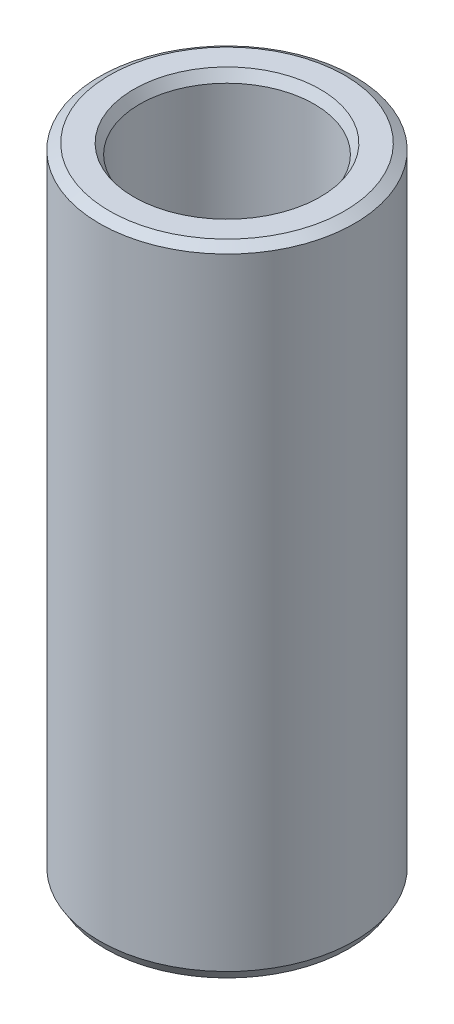
ISO-10303-21;
HEADER;
FILE_DESCRIPTION(('STEP AP214'),'2;1');
FILE_NAME('part.step','',(''),(''),'','','');
FILE_SCHEMA(('AUTOMOTIVE_DESIGN { 1 0 10303 214 1 1 1 1 }'));
ENDSEC;
DATA;
#1=APPLICATION_CONTEXT('core data for automotive mechanical design processes');
#2=APPLICATION_PROTOCOL_DEFINITION('international standard','automotive_design',2000,#1);
#3=PRODUCT_CONTEXT('',#1,'mechanical');
#4=PRODUCT('Part','Part','',(#3));
#5=PRODUCT_RELATED_PRODUCT_CATEGORY('part','',(#4));
#6=PRODUCT_DEFINITION_FORMATION('','',#4);
#7=PRODUCT_DEFINITION_CONTEXT('part definition',#1,'design');
#8=PRODUCT_DEFINITION('design','',#6,#7);
#9=PRODUCT_DEFINITION_SHAPE('','',#8);
#10=(LENGTH_UNIT() NAMED_UNIT(*) SI_UNIT(.MILLI.,.METRE.));
#11=(NAMED_UNIT(*) PLANE_ANGLE_UNIT() SI_UNIT($,.RADIAN.));
#12=(NAMED_UNIT(*) SI_UNIT($,.STERADIAN.) SOLID_ANGLE_UNIT());
#13=UNCERTAINTY_MEASURE_WITH_UNIT(LENGTH_MEASURE(1.E-05),#10,'distance_accuracy_value','');
#14=(GEOMETRIC_REPRESENTATION_CONTEXT(3) GLOBAL_UNCERTAINTY_ASSIGNED_CONTEXT((#13)) GLOBAL_UNIT_ASSIGNED_CONTEXT((#10,
#11,#12)) REPRESENTATION_CONTEXT('',''));
#15=CARTESIAN_POINT('',(0.,0.,0.));
#16=DIRECTION('',(0.,0.,1.));
#17=DIRECTION('',(1.,0.,0.));
#18=AXIS2_PLACEMENT_3D('',#15,#16,#17);
#19=CARTESIAN_POINT('',(0.,224.977429232569,0.));
#20=DIRECTION('',(0.,-1.,0.));
#21=DIRECTION('',(0.,0.,-1.));
#22=AXIS2_PLACEMENT_3D('',#19,#20,#21);
#23=CYLINDRICAL_SURFACE('',#22,45.);
#24=CARTESIAN_POINT('',(0.,3.47307751984191,0.));
#25=DIRECTION('',(0.,1.,0.));
#26=DIRECTION('',(0.,0.,1.));
#27=AXIS2_PLACEMENT_3D('',#24,#25,#26);
#28=CIRCLE('',#27,45.);
#29=CARTESIAN_POINT('',(0.,3.47307751984188,-45.));
#30=VERTEX_POINT('',#29);
#31=EDGE_CURVE('E10',#30,#30,#28,.T.);
#32=CARTESIAN_POINT('',(0.,222.857607151526,0.));
#33=DIRECTION('',(0.,1.,0.));
#34=DIRECTION('',(0.,0.,1.));
#35=AXIS2_PLACEMENT_3D('',#32,#33,#34);
#36=CIRCLE('',#35,45.);
#37=CARTESIAN_POINT('',(0.,222.857607151526,-45.));
#38=VERTEX_POINT('',#37);
#39=EDGE_CURVE('E50',#38,#38,#36,.F.);
#40=CARTESIAN_POINT('',(0.,3.47307751984188,-45.));
#41=CARTESIAN_POINT('',(0.,5.75833303683859,-45.));
#42=CARTESIAN_POINT('',(0.,8.0435885538353,-45.));
#43=CARTESIAN_POINT('',(0.,12.6140995878287,-45.));
#44=CARTESIAN_POINT('',(0.,14.8993551048254,-45.));
#45=CARTESIAN_POINT('',(0.,19.4698661388189,-45.));
#46=CARTESIAN_POINT('',(0.,21.7551216558156,-45.));
#47=CARTESIAN_POINT('',(0.,26.325632689809,-45.));
#48=CARTESIAN_POINT('',(0.,28.6108882068057,-45.));
#49=CARTESIAN_POINT('',(0.,33.1813992407992,-45.));
#50=CARTESIAN_POINT('',(0.,35.4666547577959,-45.));
#51=CARTESIAN_POINT('',(0.,40.0371657917893,-45.));
#52=CARTESIAN_POINT('',(0.,42.322421308786,-45.));
#53=CARTESIAN_POINT('',(0.,46.8929323427794,-45.));
#54=CARTESIAN_POINT('',(0.,49.1781878597761,-45.));
#55=CARTESIAN_POINT('',(0.,53.7486988937696,-45.));
#56=CARTESIAN_POINT('',(0.,56.0339544107663,-45.));
#57=CARTESIAN_POINT('',(0.,60.6044654447597,-45.));
#58=CARTESIAN_POINT('',(0.,62.8897209617564,-45.));
#59=CARTESIAN_POINT('',(0.,67.4602319957499,-45.));
#60=CARTESIAN_POINT('',(0.,69.7454875127466,-45.));
#61=CARTESIAN_POINT('',(0.,74.31599854674,-45.));
#62=CARTESIAN_POINT('',(0.,76.6012540637367,-45.));
#63=CARTESIAN_POINT('',(0.,81.1717650977301,-45.));
#64=CARTESIAN_POINT('',(0.,83.4570206147268,-45.));
#65=CARTESIAN_POINT('',(0.,88.0275316487203,-45.));
#66=CARTESIAN_POINT('',(0.,90.312787165717,-45.));
#67=CARTESIAN_POINT('',(0.,94.8832981997104,-45.));
#68=CARTESIAN_POINT('',(0.,97.1685537167071,-45.));
#69=CARTESIAN_POINT('',(0.,101.739064750701,-45.));
#70=CARTESIAN_POINT('',(0.,104.024320267697,-45.));
#71=CARTESIAN_POINT('',(0.,108.594831301691,-45.));
#72=CARTESIAN_POINT('',(0.,110.880086818687,-45.));
#73=CARTESIAN_POINT('',(0.,115.450597852681,-45.));
#74=CARTESIAN_POINT('',(0.,117.735853369678,-45.));
#75=CARTESIAN_POINT('',(0.,122.306364403671,-45.));
#76=CARTESIAN_POINT('',(0.,124.591619920668,-45.));
#77=CARTESIAN_POINT('',(0.,129.162130954661,-45.));
#78=CARTESIAN_POINT('',(0.,131.447386471658,-45.));
#79=CARTESIAN_POINT('',(0.,136.017897505651,-45.));
#80=CARTESIAN_POINT('',(0.,138.303153022648,-45.));
#81=CARTESIAN_POINT('',(0.,142.873664056641,-45.));
#82=CARTESIAN_POINT('',(0.,145.158919573638,-45.));
#83=CARTESIAN_POINT('',(0.,149.729430607632,-45.));
#84=CARTESIAN_POINT('',(0.,152.014686124628,-45.));
#85=CARTESIAN_POINT('',(0.,156.585197158622,-45.));
#86=CARTESIAN_POINT('',(0.,158.870452675618,-45.));
#87=CARTESIAN_POINT('',(0.,163.440963709612,-45.));
#88=CARTESIAN_POINT('',(0.,165.726219226608,-45.));
#89=CARTESIAN_POINT('',(0.,170.296730260602,-45.));
#90=CARTESIAN_POINT('',(0.,172.581985777599,-45.));
#91=CARTESIAN_POINT('',(0.,177.152496811592,-45.));
#92=CARTESIAN_POINT('',(0.,179.437752328589,-45.));
#93=CARTESIAN_POINT('',(0.,184.008263362582,-45.));
#94=CARTESIAN_POINT('',(0.,186.293518879579,-45.));
#95=CARTESIAN_POINT('',(0.,190.864029913572,-45.));
#96=CARTESIAN_POINT('',(0.,193.149285430569,-45.));
#97=CARTESIAN_POINT('',(0.,197.719796464562,-45.));
#98=CARTESIAN_POINT('',(0.,200.005051981559,-45.));
#99=CARTESIAN_POINT('',(0.,204.575563015553,-45.));
#100=CARTESIAN_POINT('',(0.,206.860818532549,-45.));
#101=CARTESIAN_POINT('',(0.,211.431329566543,-45.));
#102=CARTESIAN_POINT('',(0.,213.716585083539,-45.));
#103=CARTESIAN_POINT('',(0.,218.287096117533,-45.));
#104=CARTESIAN_POINT('',(0.,220.57235163453,-45.));
#105=CARTESIAN_POINT('',(0.,222.857607151526,-45.));
#106=B_SPLINE_CURVE_WITH_KNOTS('',3,(#40,#41,#42,#43,#44,#45,#46,#47,#48,#49,#50,#51,#52,#53,
#54,#55,#56,#57,#58,#59,#60,#61,#62,#63,#64,#65,#66,#67,#68,#69,#70,#71,#72,#73,#74,#75,#76,#77,
#78,#79,#80,#81,#82,#83,#84,#85,#86,#87,#88,#89,#90,#91,#92,#93,#94,#95,#96,#97,#98,#99,#100,
#101,#102,#103,#104,#105),.UNSPECIFIED.,.F.,.F.,(4,2,2,2,2,2,2,2,2,2,2,2,2,2,2,2,2,2,2,2,2,2,2,
2,2,2,2,2,2,2,2,2,4),(0.,6.85576655099013,13.7115331019803,20.5672996529704,27.4230662039606,
34.2788327549507,41.1345993059408,47.990365856931,54.8461324079211,61.7018989589113,
68.5576655099014,75.4134320608915,82.2691986118817,89.1249651628718,95.980731713862,
102.836498264852,109.692264815842,116.548031366832,123.403797917823,130.259564468813,
137.115331019803,143.971097570793,150.826864121783,157.682630672773,164.538397223763,
171.394163774753,178.249930325744,185.105696876734,191.961463427724,198.817229978714,
205.672996529704,212.528763080694,219.384529631684),.UNSPECIFIED.);
#107=EDGE_CURVE('BSEAM39',#30,#38,#106,.T.);
#108=ORIENTED_EDGE('',*,*,#31,.T.);
#109=ORIENTED_EDGE('',*,*,#39,.T.);
#110=ORIENTED_EDGE('',*,*,#107,.T.);
#111=ORIENTED_EDGE('',*,*,#107,.F.);
#112=EDGE_LOOP('',(#108,#110,#109,#111));
#113=FACE_BOUND('',#112,.T.);
#114=ADVANCED_FACE('F39',(#113),#23,.T.);
#115=CARTESIAN_POINT('',(0.,224.977429232569,0.));
#116=DIRECTION('',(0.,1.,0.));
#117=DIRECTION('',(0.,0.,1.));
#118=AXIS2_PLACEMENT_3D('',#115,#116,#117);
#119=PLANE('',#118);
#120=CARTESIAN_POINT('',(0.,224.977429232569,0.));
#121=DIRECTION('',(0.,1.,0.));
#122=DIRECTION('',(0.,0.,1.));
#123=AXIS2_PLACEMENT_3D('',#120,#121,#122);
#124=CIRCLE('',#123,32.9353496207684);
#125=CARTESIAN_POINT('',(0.,224.977429232569,32.9353496207684));
#126=VERTEX_POINT('',#125);
#127=EDGE_CURVE('E58',#126,#126,#124,.F.);
#128=ORIENTED_EDGE('',*,*,#127,.T.);
#129=EDGE_LOOP('',(#128));
#130=FACE_BOUND('',#129,.T.);
#131=CARTESIAN_POINT('',(0.,224.977429232569,0.));
#132=DIRECTION('',(0.,1.,0.));
#133=DIRECTION('',(0.,0.,1.));
#134=AXIS2_PLACEMENT_3D('',#131,#132,#133);
#135=CIRCLE('',#134,41.5269224801587);
#136=CARTESIAN_POINT('',(0.,224.977429232569,-41.5269224801587));
#137=VERTEX_POINT('',#136);
#138=EDGE_CURVE('E61',#137,#137,#135,.T.);
#139=ORIENTED_EDGE('',*,*,#138,.T.);
#140=EDGE_LOOP('',(#139));
#141=FACE_BOUND('',#140,.T.);
#142=ADVANCED_FACE('F88',(#130,#141),#119,.T.);
#143=CARTESIAN_POINT('',(0.,0.,0.));
#144=DIRECTION('',(0.,1.,0.));
#145=DIRECTION('',(0.,0.,1.));
#146=AXIS2_PLACEMENT_3D('',#143,#144,#145);
#147=PLANE('',#146);
#148=CARTESIAN_POINT('',(0.,0.,0.));
#149=DIRECTION('',(0.,1.,0.));
#150=DIRECTION('',(0.,0.,1.));
#151=AXIS2_PLACEMENT_3D('',#148,#149,#150);
#152=CIRCLE('',#151,34.2886050595665);
#153=CARTESIAN_POINT('',(0.,0.,-34.2886050595665));
#154=VERTEX_POINT('',#153);
#155=EDGE_CURVE('E51',#154,#154,#152,.T.);
#156=ORIENTED_EDGE('',*,*,#155,.T.);
#157=EDGE_LOOP('',(#156));
#158=FACE_BOUND('',#157,.T.);
#159=CARTESIAN_POINT('',(0.,0.,0.));
#160=DIRECTION('',(0.,1.,0.));
#161=DIRECTION('',(0.,0.,1.));
#162=AXIS2_PLACEMENT_3D('',#159,#160,#161);
#163=CIRCLE('',#162,42.8801779189566);
#164=CARTESIAN_POINT('',(0.,0.,42.8801779189566));
#165=VERTEX_POINT('',#164);
#166=EDGE_CURVE('E54',#165,#165,#163,.F.);
#167=ORIENTED_EDGE('',*,*,#166,.T.);
#168=EDGE_LOOP('',(#167));
#169=FACE_BOUND('',#168,.T.);
#170=ADVANCED_FACE('F83',(#158,#169),#147,.F.);
#171=CARTESIAN_POINT('',(0.,224.977429232569,0.));
#172=DIRECTION('',(0.,-1.,0.));
#173=DIRECTION('',(0.,0.,-1.));
#174=AXIS2_PLACEMENT_3D('',#171,#172,#173);
#175=CYLINDRICAL_SURFACE('',#174,30.8155275397251);
#176=CARTESIAN_POINT('',(0.,221.504351712728,0.));
#177=DIRECTION('',(0.,1.,0.));
#178=DIRECTION('',(0.,0.,1.));
#179=AXIS2_PLACEMENT_3D('',#176,#177,#178);
#180=CIRCLE('',#179,30.8155275397251);
#181=CARTESIAN_POINT('',(0.,221.504351712728,-30.8155275397251));
#182=VERTEX_POINT('',#181);
#183=EDGE_CURVE('E67',#182,#182,#180,.T.);
#184=CARTESIAN_POINT('',(0.,2.11982208104314,0.));
#185=DIRECTION('',(0.,1.,0.));
#186=DIRECTION('',(0.,0.,1.));
#187=AXIS2_PLACEMENT_3D('',#184,#185,#186);
#188=CIRCLE('',#187,30.8155275397251);
#189=CARTESIAN_POINT('',(0.,2.11982208104311,-30.8155275397251));
#190=VERTEX_POINT('',#189);
#191=EDGE_CURVE('E69',#190,#190,#188,.F.);
#192=CARTESIAN_POINT('',(0.,221.504351712728,-30.8155275397251));
#193=CARTESIAN_POINT('',(0.,219.219096195731,-30.8155275397251));
#194=CARTESIAN_POINT('',(0.,216.933840678734,-30.8155275397251));
#195=CARTESIAN_POINT('',(0.,212.363329644741,-30.8155275397251));
#196=CARTESIAN_POINT('',(0.,210.078074127744,-30.8155275397251));
#197=CARTESIAN_POINT('',(0.,205.507563093751,-30.8155275397251));
#198=CARTESIAN_POINT('',(0.,203.222307576754,-30.8155275397251));
#199=CARTESIAN_POINT('',(0.,198.65179654276,-30.8155275397251));
#200=CARTESIAN_POINT('',(0.,196.366541025764,-30.8155275397251));
#201=CARTESIAN_POINT('',(0.,191.79602999177,-30.8155275397251));
#202=CARTESIAN_POINT('',(0.,189.510774474774,-30.8155275397251));
#203=CARTESIAN_POINT('',(0.,184.94026344078,-30.8155275397251));
#204=CARTESIAN_POINT('',(0.,182.655007923783,-30.8155275397251));
#205=CARTESIAN_POINT('',(0.,178.08449688979,-30.8155275397251));
#206=CARTESIAN_POINT('',(0.,175.799241372793,-30.8155275397251));
#207=CARTESIAN_POINT('',(0.,171.2287303388,-30.8155275397251));
#208=CARTESIAN_POINT('',(0.,168.943474821803,-30.8155275397251));
#209=CARTESIAN_POINT('',(0.,164.37296378781,-30.8155275397251));
#210=CARTESIAN_POINT('',(0.,162.087708270813,-30.8155275397251));
#211=CARTESIAN_POINT('',(0.,157.51719723682,-30.8155275397251));
#212=CARTESIAN_POINT('',(0.,155.231941719823,-30.8155275397251));
#213=CARTESIAN_POINT('',(0.,150.661430685829,-30.8155275397251));
#214=CARTESIAN_POINT('',(0.,148.376175168833,-30.8155275397251));
#215=CARTESIAN_POINT('',(0.,143.805664134839,-30.8155275397251));
#216=CARTESIAN_POINT('',(0.,141.520408617843,-30.8155275397251));
#217=CARTESIAN_POINT('',(0.,136.949897583849,-30.8155275397251));
#218=CARTESIAN_POINT('',(0.,134.664642066852,-30.8155275397251));
#219=CARTESIAN_POINT('',(0.,130.094131032859,-30.8155275397251));
#220=CARTESIAN_POINT('',(0.,127.808875515862,-30.8155275397251));
#221=CARTESIAN_POINT('',(0.,123.238364481869,-30.8155275397251));
#222=CARTESIAN_POINT('',(0.,120.953108964872,-30.8155275397251));
#223=CARTESIAN_POINT('',(0.,116.382597930879,-30.8155275397251));
#224=CARTESIAN_POINT('',(0.,114.097342413882,-30.8155275397251));
#225=CARTESIAN_POINT('',(0.,109.526831379889,-30.8155275397251));
#226=CARTESIAN_POINT('',(0.,107.241575862892,-30.8155275397251));
#227=CARTESIAN_POINT('',(0.,102.671064828898,-30.8155275397251));
#228=CARTESIAN_POINT('',(0.,100.385809311902,-30.8155275397251));
#229=CARTESIAN_POINT('',(0.,95.8152982779084,-30.8155275397251));
#230=CARTESIAN_POINT('',(0.,93.5300427609116,-30.8155275397251));
#231=CARTESIAN_POINT('',(0.,88.9595317269182,-30.8155275397251));
#232=CARTESIAN_POINT('',(0.,86.6742762099215,-30.8155275397251));
#233=CARTESIAN_POINT('',(0.,82.1037651759281,-30.8155275397251));
#234=CARTESIAN_POINT('',(0.,79.8185096589314,-30.8155275397251));
#235=CARTESIAN_POINT('',(0.,75.247998624938,-30.8155275397251));
#236=CARTESIAN_POINT('',(0.,72.9627431079412,-30.8155275397251));
#237=CARTESIAN_POINT('',(0.,68.3922320739478,-30.8155275397251));
#238=CARTESIAN_POINT('',(0.,66.1069765569511,-30.8155275397251));
#239=CARTESIAN_POINT('',(0.,61.5364655229577,-30.8155275397251));
#240=CARTESIAN_POINT('',(0.,59.2512100059609,-30.8155275397251));
#241=CARTESIAN_POINT('',(0.,54.6806989719675,-30.8155275397251));
#242=CARTESIAN_POINT('',(0.,52.3954434549708,-30.8155275397251));
#243=CARTESIAN_POINT('',(0.,47.8249324209774,-30.8155275397251));
#244=CARTESIAN_POINT('',(0.,45.5396769039807,-30.8155275397251));
#245=CARTESIAN_POINT('',(0.,40.9691658699872,-30.8155275397251));
#246=CARTESIAN_POINT('',(0.,38.6839103529905,-30.8155275397251));
#247=CARTESIAN_POINT('',(0.,34.1133993189971,-30.8155275397251));
#248=CARTESIAN_POINT('',(0.,31.8281438020004,-30.8155275397251));
#249=CARTESIAN_POINT('',(0.,27.257632768007,-30.8155275397251));
#250=CARTESIAN_POINT('',(0.,24.9723772510103,-30.8155275397251));
#251=CARTESIAN_POINT('',(0.,20.4018662170168,-30.8155275397251));
#252=CARTESIAN_POINT('',(0.,18.1166107000201,-30.8155275397251));
#253=CARTESIAN_POINT('',(0.,13.5460996660267,-30.8155275397251));
#254=CARTESIAN_POINT('',(0.,11.2608441490299,-30.8155275397251));
#255=CARTESIAN_POINT('',(0.,6.69033311503653,-30.8155275397251));
#256=CARTESIAN_POINT('',(0.,4.40507759803982,-30.8155275397251));
#257=CARTESIAN_POINT('',(0.,2.11982208104311,-30.8155275397251));
#258=B_SPLINE_CURVE_WITH_KNOTS('',3,(#192,#193,#194,#195,#196,#197,#198,#199,#200,#201,#202,
#203,#204,#205,#206,#207,#208,#209,#210,#211,#212,#213,#214,#215,#216,#217,#218,#219,#220,#221,
#222,#223,#224,#225,#226,#227,#228,#229,#230,#231,#232,#233,#234,#235,#236,#237,#238,#239,#240,
#241,#242,#243,#244,#245,#246,#247,#248,#249,#250,#251,#252,#253,#254,#255,#256,#257),
.UNSPECIFIED.,.F.,.F.,(4,2,2,2,2,2,2,2,2,2,2,2,2,2,2,2,2,2,2,2,2,2,2,2,2,2,2,2,2,2,2,2,4),(0.,
6.85576655099016,13.7115331019803,20.5672996529704,27.4230662039606,34.2788327549507,
41.1345993059409,47.990365856931,54.8461324079211,61.7018989589113,68.5576655099014,
75.4134320608915,82.2691986118817,89.1249651628719,95.980731713862,102.836498264852,
109.692264815842,116.548031366832,123.403797917823,130.259564468813,137.115331019803,
143.971097570793,150.826864121783,157.682630672773,164.538397223763,171.394163774754,
178.249930325744,185.105696876734,191.961463427724,198.817229978714,205.672996529704,
212.528763080694,219.384529631685),.UNSPECIFIED.);
#259=EDGE_CURVE('BSEAM71',#182,#190,#258,.T.);
#260=ORIENTED_EDGE('',*,*,#183,.T.);
#261=ORIENTED_EDGE('',*,*,#191,.T.);
#262=ORIENTED_EDGE('',*,*,#259,.T.);
#263=ORIENTED_EDGE('',*,*,#259,.F.);
#264=EDGE_LOOP('',(#260,#262,#261,#263));
#265=FACE_BOUND('',#264,.T.);
#266=ADVANCED_FACE('F71',(#265),#175,.F.);
#267=CARTESIAN_POINT('',(0.,221.504351712728,0.));
#268=DIRECTION('',(0.,1.,0.));
#269=DIRECTION('',(0.,0.,1.));
#270=AXIS2_PLACEMENT_3D('',#267,#268,#269);
#271=CONICAL_SURFACE('',#270,30.8155275397251,0.548001186560236);
#272=ORIENTED_EDGE('',*,*,#127,.F.);
#273=EDGE_LOOP('',(#272));
#274=FACE_BOUND('',#273,.T.);
#275=ORIENTED_EDGE('',*,*,#183,.F.);
#276=EDGE_LOOP('',(#275));
#277=FACE_BOUND('',#276,.T.);
#278=ADVANCED_FACE('F77',(#274,#277),#271,.F.);
#279=CARTESIAN_POINT('',(0.,0.,0.));
#280=DIRECTION('',(0.,-1.,0.));
#281=DIRECTION('',(0.,0.,-1.));
#282=AXIS2_PLACEMENT_3D('',#279,#280,#281);
#283=CONICAL_SURFACE('',#282,34.2886050595665,1.02279514023465);
#284=CARTESIAN_POINT('',(0.,2.11982208104314,-30.8155275397251));
#285=CARTESIAN_POINT('',(0.,2.09774060103227,-30.8517054305568));
#286=CARTESIAN_POINT('',(0.,2.07565912102141,-30.8878833213885));
#287=CARTESIAN_POINT('',(0.,2.03149616099967,-30.9602391030518));
#288=CARTESIAN_POINT('',(0.,2.00941468098881,-30.9964169938835));
#289=CARTESIAN_POINT('',(0.,1.96525172096708,-31.0687727755469));
#290=CARTESIAN_POINT('',(0.,1.94317024095621,-31.1049506663785));
#291=CARTESIAN_POINT('',(0.,1.89900728093448,-31.1773064480419));
#292=CARTESIAN_POINT('',(0.,1.87692580092361,-31.2134843388736));
#293=CARTESIAN_POINT('',(0.,1.83276284090188,-31.2858401205369));
#294=CARTESIAN_POINT('',(0.,1.81068136089101,-31.3220180113686));
#295=CARTESIAN_POINT('',(0.,1.76651840086928,-31.394373793032));
#296=CARTESIAN_POINT('',(0.,1.74443692085841,-31.4305516838637));
#297=CARTESIAN_POINT('',(0.,1.70027396083668,-31.502907465527));
#298=CARTESIAN_POINT('',(0.,1.67819248082582,-31.5390853563587));
#299=CARTESIAN_POINT('',(0.,1.63402952080409,-31.6114411380221));
#300=CARTESIAN_POINT('',(0.,1.61194804079322,-31.6476190288538));
#301=CARTESIAN_POINT('',(0.,1.56778508077149,-31.7199748105171));
#302=CARTESIAN_POINT('',(0.,1.54570360076062,-31.7561527013488));
#303=CARTESIAN_POINT('',(0.,1.50154064073889,-31.8285084830122));
#304=CARTESIAN_POINT('',(0.,1.47945916072802,-31.8646863738439));
#305=CARTESIAN_POINT('',(0.,1.43529620070629,-31.9370421555072));
#306=CARTESIAN_POINT('',(0.,1.41321472069542,-31.9732200463389));
#307=CARTESIAN_POINT('',(0.,1.36905176067369,-32.0455758280023));
#308=CARTESIAN_POINT('',(0.,1.34697028066283,-32.0817537188339));
#309=CARTESIAN_POINT('',(0.,1.3028073206411,-32.1541095004973));
#310=CARTESIAN_POINT('',(0.,1.28072584063023,-32.190287391329));
#311=CARTESIAN_POINT('',(0.,1.2365628806085,-32.2626431729923));
#312=CARTESIAN_POINT('',(0.,1.21448140059763,-32.298821063824));
#313=CARTESIAN_POINT('',(0.,1.1703184405759,-32.3711768454874));
#314=CARTESIAN_POINT('',(0.,1.14823696056503,-32.4073547363191));
#315=CARTESIAN_POINT('',(0.,1.1040740005433,-32.4797105179824));
#316=CARTESIAN_POINT('',(0.,1.08199252053243,-32.5158884088141));
#317=CARTESIAN_POINT('',(0.,1.0378295605107,-32.5882441904775));
#318=CARTESIAN_POINT('',(0.,1.01574808049984,-32.6244220813092));
#319=CARTESIAN_POINT('',(0.,0.971585120478105,-32.6967778629725));
#320=CARTESIAN_POINT('',(0.,0.949503640467239,-32.7329557538042));
#321=CARTESIAN_POINT('',(0.,0.905340680445507,-32.8053115354676));
#322=CARTESIAN_POINT('',(0.,0.883259200434641,-32.8414894262993));
#323=CARTESIAN_POINT('',(0.,0.839096240412909,-32.9138452079626));
#324=CARTESIAN_POINT('',(0.,0.817014760402042,-32.9500230987943));
#325=CARTESIAN_POINT('',(0.,0.77285180038031,-33.0223788804577));
#326=CARTESIAN_POINT('',(0.,0.750770320369444,-33.0585567712893));
#327=CARTESIAN_POINT('',(0.,0.706607360347713,-33.1309125529527));
#328=CARTESIAN_POINT('',(0.,0.684525880336846,-33.1670904437844));
#329=CARTESIAN_POINT('',(0.,0.640362920315115,-33.2394462254478));
#330=CARTESIAN_POINT('',(0.,0.618281440304249,-33.2756241162794));
#331=CARTESIAN_POINT('',(0.,0.574118480282517,-33.3479798979428));
#332=CARTESIAN_POINT('',(0.,0.55203700027165,-33.3841577887745));
#333=CARTESIAN_POINT('',(0.,0.507874040249918,-33.4565135704378));
#334=CARTESIAN_POINT('',(0.,0.485792560239052,-33.4926914612695));
#335=CARTESIAN_POINT('',(0.,0.441629600217321,-33.5650472429329));
#336=CARTESIAN_POINT('',(0.,0.419548120206455,-33.6012251337646));
#337=CARTESIAN_POINT('',(0.,0.375385160184723,-33.6735809154279));
#338=CARTESIAN_POINT('',(0.,0.353303680173856,-33.7097588062596));
#339=CARTESIAN_POINT('',(0.,0.309140720152124,-33.782114587923));
#340=CARTESIAN_POINT('',(0.,0.287059240141258,-33.8182924787547));
#341=CARTESIAN_POINT('',(0.,0.242896280119526,-33.890648260418));
#342=CARTESIAN_POINT('',(0.,0.22081480010866,-33.9268261512497));
#343=CARTESIAN_POINT('',(0.,0.176651840086928,-33.9991819329131));
#344=CARTESIAN_POINT('',(0.,0.154570360076063,-34.0353598237447));
#345=CARTESIAN_POINT('',(0.,0.110407400054331,-34.1077156054081));
#346=CARTESIAN_POINT('',(0.,0.088325920043464,-34.1438934962398));
#347=CARTESIAN_POINT('',(0.,0.044162960021731,-34.2162492779032));
#348=CARTESIAN_POINT('',(0.,0.0220814800108645,-34.2524271687348));
#349=CARTESIAN_POINT('',(0.,0.,-34.2886050595665));
#350=B_SPLINE_CURVE_WITH_KNOTS('',3,(#284,#285,#286,#287,#288,#289,#290,#291,#292,#293,#294,
#295,#296,#297,#298,#299,#300,#301,#302,#303,#304,#305,#306,#307,#308,#309,#310,#311,#312,#313,
#314,#315,#316,#317,#318,#319,#320,#321,#322,#323,#324,#325,#326,#327,#328,#329,#330,#331,#332,
#333,#334,#335,#336,#337,#338,#339,#340,#341,#342,#343,#344,#345,#346,#347,#348,#349),
.UNSPECIFIED.,.F.,.F.,(4,2,2,2,2,2,2,2,2,2,2,2,2,2,2,2,2,2,2,2,2,2,2,2,2,2,2,2,2,2,2,2,4),(0.,
0.127152994068148,0.254305988136294,0.381458982204439,0.508611976272587,0.635764970340735,
0.762917964408877,0.890070958477026,1.01722395254517,1.14437694661332,1.27152994068146,
1.39868293474961,1.52583592881776,1.6529889228859,1.78014191695405,1.9072949110222,
2.03444790509034,2.16160089915849,2.28875389322664,2.41590688729479,2.54305988136293,
2.67021287543108,2.79736586949923,2.92451886356737,3.05167185763552,3.17882485170366,
3.30597784577181,3.43313083983995,3.5602838339081,3.68743682797625,3.8145898220444,
3.94174281611254,4.06889581018069),.UNSPECIFIED.);
#351=EDGE_CURVE('BSEAM73',#190,#154,#350,.T.);
#352=ORIENTED_EDGE('',*,*,#191,.F.);
#353=ORIENTED_EDGE('',*,*,#155,.F.);
#354=ORIENTED_EDGE('',*,*,#351,.T.);
#355=ORIENTED_EDGE('',*,*,#351,.F.);
#356=EDGE_LOOP('',(#352,#354,#353,#355));
#357=FACE_BOUND('',#356,.T.);
#358=ADVANCED_FACE('F73',(#357),#283,.F.);
#359=CARTESIAN_POINT('',(0.,3.47307751984191,0.));
#360=DIRECTION('',(0.,1.,0.));
#361=DIRECTION('',(0.,0.,1.));
#362=AXIS2_PLACEMENT_3D('',#359,#360,#361);
#363=CONICAL_SURFACE('',#362,45.,0.548001186560244);
#364=ORIENTED_EDGE('',*,*,#166,.F.);
#365=EDGE_LOOP('',(#364));
#366=FACE_BOUND('',#365,.T.);
#367=ORIENTED_EDGE('',*,*,#31,.F.);
#368=EDGE_LOOP('',(#367));
#369=FACE_BOUND('',#368,.T.);
#370=ADVANCED_FACE('F76',(#366,#369),#363,.T.);
#371=CARTESIAN_POINT('',(0.,224.977429232569,0.));
#372=DIRECTION('',(0.,-1.,0.));
#373=DIRECTION('',(0.,0.,-1.));
#374=AXIS2_PLACEMENT_3D('',#371,#372,#373);
#375=CONICAL_SURFACE('',#374,41.5269224801587,1.02279514023466);
#376=CARTESIAN_POINT('',(0.,222.857607151526,-45.));
#377=CARTESIAN_POINT('',(0.,222.879688631537,-44.9638221091683));
#378=CARTESIAN_POINT('',(0.,222.901770111548,-44.9276442183367));
#379=CARTESIAN_POINT('',(0.,222.94593307157,-44.8552884366733));
#380=CARTESIAN_POINT('',(0.,222.968014551581,-44.8191105458416));
#381=CARTESIAN_POINT('',(0.,223.012177511602,-44.7467547641783));
#382=CARTESIAN_POINT('',(0.,223.034258991613,-44.7105768733466));
#383=CARTESIAN_POINT('',(0.,223.078421951635,-44.6382210916832));
#384=CARTESIAN_POINT('',(0.,223.100503431646,-44.6020432008515));
#385=CARTESIAN_POINT('',(0.,223.144666391668,-44.5296874191882));
#386=CARTESIAN_POINT('',(0.,223.166747871678,-44.4935095283565));
#387=CARTESIAN_POINT('',(0.,223.2109108317,-44.4211537466931));
#388=CARTESIAN_POINT('',(0.,223.232992311711,-44.3849758558614));
#389=CARTESIAN_POINT('',(0.,223.277155271733,-44.3126200741981));
#390=CARTESIAN_POINT('',(0.,223.299236751744,-44.2764421833664));
#391=CARTESIAN_POINT('',(0.,223.343399711765,-44.2040864017031));
#392=CARTESIAN_POINT('',(0.,223.365481191776,-44.1679085108714));
#393=CARTESIAN_POINT('',(0.,223.409644151798,-44.095552729208));
#394=CARTESIAN_POINT('',(0.,223.431725631809,-44.0593748383763));
#395=CARTESIAN_POINT('',(0.,223.475888591831,-43.987019056713));
#396=CARTESIAN_POINT('',(0.,223.497970071841,-43.9508411658813));
#397=CARTESIAN_POINT('',(0.,223.542133031863,-43.8784853842179));
#398=CARTESIAN_POINT('',(0.,223.564214511874,-43.8423074933862));
#399=CARTESIAN_POINT('',(0.,223.608377471896,-43.7699517117229));
#400=CARTESIAN_POINT('',(0.,223.630458951907,-43.7337738208912));
#401=CARTESIAN_POINT('',(0.,223.674621911928,-43.6614180392278));
#402=CARTESIAN_POINT('',(0.,223.696703391939,-43.6252401483962));
#403=CARTESIAN_POINT('',(0.,223.740866351961,-43.5528843667328));
#404=CARTESIAN_POINT('',(0.,223.762947831972,-43.5167064759011));
#405=CARTESIAN_POINT('',(0.,223.807110791994,-43.4443506942377));
#406=CARTESIAN_POINT('',(0.,223.829192272004,-43.4081728034061));
#407=CARTESIAN_POINT('',(0.,223.873355232026,-43.3358170217427));
#408=CARTESIAN_POINT('',(0.,223.895436712037,-43.299639130911));
#409=CARTESIAN_POINT('',(0.,223.939599672059,-43.2272833492477));
#410=CARTESIAN_POINT('',(0.,223.96168115207,-43.191105458416));
#411=CARTESIAN_POINT('',(0.,224.005844112091,-43.1187496767526));
#412=CARTESIAN_POINT('',(0.,224.027925592102,-43.0825717859209));
#413=CARTESIAN_POINT('',(0.,224.072088552124,-43.0102160042576));
#414=CARTESIAN_POINT('',(0.,224.094170032135,-42.9740381134259));
#415=CARTESIAN_POINT('',(0.,224.138332992156,-42.9016823317625));
#416=CARTESIAN_POINT('',(0.,224.160414472167,-42.8655044409309));
#417=CARTESIAN_POINT('',(0.,224.204577432189,-42.7931486592675));
#418=CARTESIAN_POINT('',(0.,224.2266589122,-42.7569707684358));
#419=CARTESIAN_POINT('',(0.,224.270821872222,-42.6846149867725));
#420=CARTESIAN_POINT('',(0.,224.292903352233,-42.6484370959408));
#421=CARTESIAN_POINT('',(0.,224.337066312254,-42.5760813142774));
#422=CARTESIAN_POINT('',(0.,224.359147792265,-42.5399034234457));
#423=CARTESIAN_POINT('',(0.,224.403310752287,-42.4675476417824));
#424=CARTESIAN_POINT('',(0.,224.425392232298,-42.4313697509507));
#425=CARTESIAN_POINT('',(0.,224.469555192319,-42.3590139692873));
#426=CARTESIAN_POINT('',(0.,224.49163667233,-42.3228360784556));
#427=CARTESIAN_POINT('',(0.,224.535799632352,-42.2504802967923));
#428=CARTESIAN_POINT('',(0.,224.557881112363,-42.2143024059606));
#429=CARTESIAN_POINT('',(0.,224.602044072385,-42.1419466242973));
#430=CARTESIAN_POINT('',(0.,224.624125552396,-42.1057687334656));
#431=CARTESIAN_POINT('',(0.,224.668288512417,-42.0334129518022));
#432=CARTESIAN_POINT('',(0.,224.690369992428,-41.9972350609705));
#433=CARTESIAN_POINT('',(0.,224.73453295245,-41.9248792793072));
#434=CARTESIAN_POINT('',(0.,224.756614432461,-41.8887013884755));
#435=CARTESIAN_POINT('',(0.,224.800777392482,-41.8163456068121));
#436=CARTESIAN_POINT('',(0.,224.822858872493,-41.7801677159804));
#437=CARTESIAN_POINT('',(0.,224.867021832515,-41.7078119343171));
#438=CARTESIAN_POINT('',(0.,224.889103312526,-41.6716340434854));
#439=CARTESIAN_POINT('',(0.,224.933266272548,-41.599278261822));
#440=CARTESIAN_POINT('',(0.,224.955347752559,-41.5631003709903));
#441=CARTESIAN_POINT('',(0.,224.977429232569,-41.5269224801587));
#442=B_SPLINE_CURVE_WITH_KNOTS('',3,(#376,#377,#378,#379,#380,#381,#382,#383,#384,#385,#386,
#387,#388,#389,#390,#391,#392,#393,#394,#395,#396,#397,#398,#399,#400,#401,#402,#403,#404,#405,
#406,#407,#408,#409,#410,#411,#412,#413,#414,#415,#416,#417,#418,#419,#420,#421,#422,#423,#424,
#425,#426,#427,#428,#429,#430,#431,#432,#433,#434,#435,#436,#437,#438,#439,#440,#441),
.UNSPECIFIED.,.F.,.F.,(4,2,2,2,2,2,2,2,2,2,2,2,2,2,2,2,2,2,2,2,2,2,2,2,2,2,2,2,2,2,2,2,4),(0.,
0.127152994068136,0.254305988136273,0.381458982204415,0.508611976272566,0.635764970340708,
0.762917964408845,0.890070958476996,1.01722395254514,1.14437694661327,1.27152994068143,
1.39868293474957,1.5258359288177,1.65298892288586,1.780141916954,1.90729491102213,
2.03444790509029,2.16160089915843,2.28875389322656,2.41590688729471,2.54305988136286,
2.670212875431,2.79736586949914,2.92451886356729,3.05167185763543,3.17882485170357,
3.30597784577172,3.43313083983986,3.56028383390799,3.68743682797615,3.81458982204429,
3.94174281611242,4.06889581018058),.UNSPECIFIED.);
#443=EDGE_CURVE('BSEAM45',#38,#137,#442,.T.);
#444=ORIENTED_EDGE('',*,*,#39,.F.);
#445=ORIENTED_EDGE('',*,*,#138,.F.);
#446=ORIENTED_EDGE('',*,*,#443,.T.);
#447=ORIENTED_EDGE('',*,*,#443,.F.);
#448=EDGE_LOOP('',(#444,#446,#445,#447));
#449=FACE_BOUND('',#448,.T.);
#450=ADVANCED_FACE('F45',(#449),#375,.T.);
#451=CLOSED_SHELL('',(#114,#142,#170,#266,#278,#358,#370,#450));
#452=MANIFOLD_SOLID_BREP('B2',#451);
#453=ADVANCED_BREP_SHAPE_REPRESENTATION('',(#18,#452),#14);
#454=SHAPE_DEFINITION_REPRESENTATION(#9,#453);
ENDSEC;
END-ISO-10303-21;
